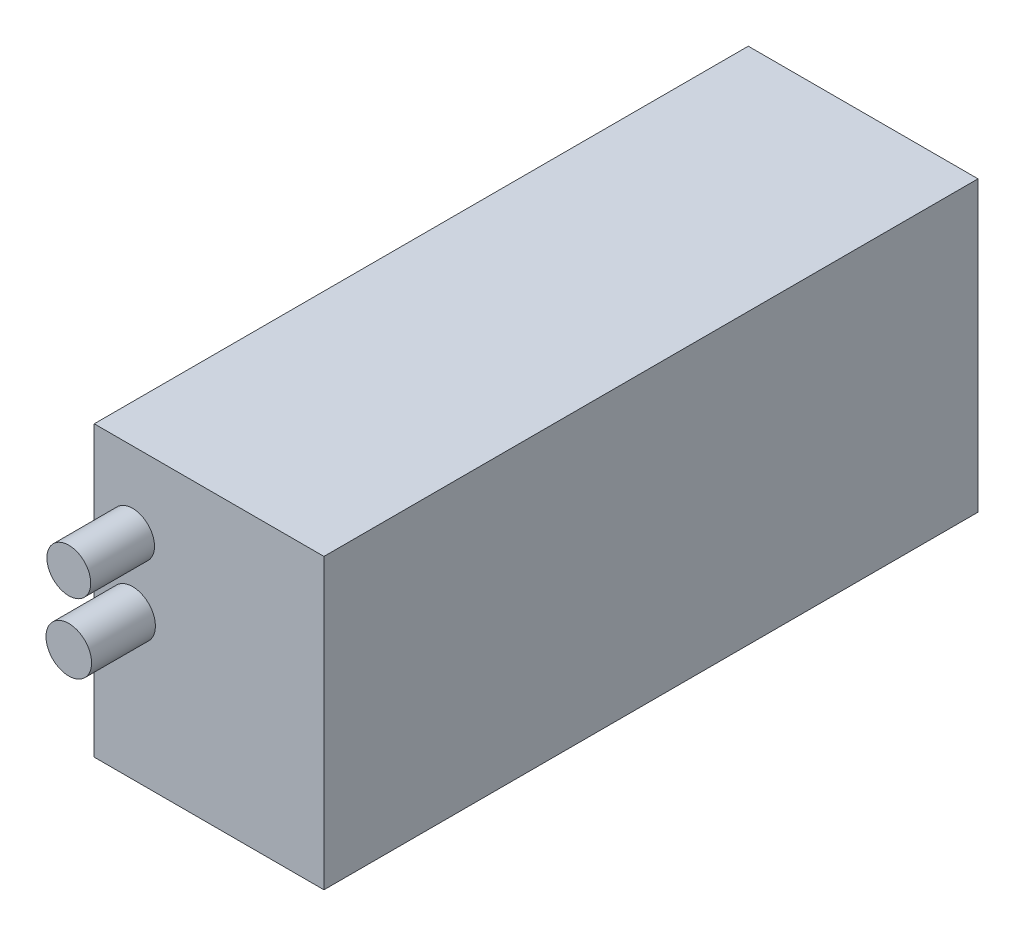
ISO-10303-21;
HEADER;
FILE_DESCRIPTION(('STEP AP214'),'2;1');
FILE_NAME('part.step','',(''),(''),'','','');
FILE_SCHEMA(('AUTOMOTIVE_DESIGN { 1 0 10303 214 1 1 1 1 }'));
ENDSEC;
DATA;
#1=APPLICATION_CONTEXT('core data for automotive mechanical design processes');
#2=APPLICATION_PROTOCOL_DEFINITION('international standard','automotive_design',2000,#1);
#3=PRODUCT_CONTEXT('',#1,'mechanical');
#4=PRODUCT('Part','Part','',(#3));
#5=PRODUCT_RELATED_PRODUCT_CATEGORY('part','',(#4));
#6=PRODUCT_DEFINITION_FORMATION('','',#4);
#7=PRODUCT_DEFINITION_CONTEXT('part definition',#1,'design');
#8=PRODUCT_DEFINITION('design','',#6,#7);
#9=PRODUCT_DEFINITION_SHAPE('','',#8);
#10=(LENGTH_UNIT() NAMED_UNIT(*) SI_UNIT(.MILLI.,.METRE.));
#11=(NAMED_UNIT(*) PLANE_ANGLE_UNIT() SI_UNIT($,.RADIAN.));
#12=(NAMED_UNIT(*) SI_UNIT($,.STERADIAN.) SOLID_ANGLE_UNIT());
#13=UNCERTAINTY_MEASURE_WITH_UNIT(LENGTH_MEASURE(1.E-05),#10,'distance_accuracy_value','');
#14=(GEOMETRIC_REPRESENTATION_CONTEXT(3) GLOBAL_UNCERTAINTY_ASSIGNED_CONTEXT((#13)) GLOBAL_UNIT_ASSIGNED_CONTEXT((#10,
#11,#12)) REPRESENTATION_CONTEXT('',''));
#15=CARTESIAN_POINT('',(0.,0.,0.));
#16=DIRECTION('',(0.,0.,1.));
#17=DIRECTION('',(1.,0.,0.));
#18=AXIS2_PLACEMENT_3D('',#15,#16,#17);
#19=CARTESIAN_POINT('',(36.,90.5,102.5));
#20=DIRECTION('',(-1.,0.,0.));
#21=DIRECTION('',(0.,0.,1.));
#22=AXIS2_PLACEMENT_3D('',#19,#20,#21);
#23=PLANE('',#22);
#24=DIRECTION('',(0.,0.,-1.));
#25=VECTOR('',#24,1.);
#26=CARTESIAN_POINT('',(36.,0.,102.5));
#27=LINE('',#26,#25);
#28=CARTESIAN_POINT('',(36.,0.,102.5));
#29=VERTEX_POINT('',#28);
#30=CARTESIAN_POINT('',(36.,0.,-102.5));
#31=VERTEX_POINT('',#30);
#32=EDGE_CURVE('E104',#29,#31,#27,.T.);
#33=ORIENTED_EDGE('',*,*,#32,.T.);
#34=DIRECTION('',(0.,-1.,0.));
#35=VECTOR('',#34,1.);
#36=CARTESIAN_POINT('',(36.,90.5,-102.5));
#37=LINE('',#36,#35);
#38=CARTESIAN_POINT('',(36.,90.5,-102.5));
#39=VERTEX_POINT('',#38);
#40=EDGE_CURVE('E95',#39,#31,#37,.T.);
#41=ORIENTED_EDGE('',*,*,#40,.F.);
#42=DIRECTION('',(0.,0.,-1.));
#43=VECTOR('',#42,1.);
#44=CARTESIAN_POINT('',(36.,90.5,102.5));
#45=LINE('',#44,#43);
#46=CARTESIAN_POINT('',(36.,90.5,102.5));
#47=VERTEX_POINT('',#46);
#48=EDGE_CURVE('E89',#47,#39,#45,.T.);
#49=ORIENTED_EDGE('',*,*,#48,.F.);
#50=DIRECTION('',(0.,-1.,0.));
#51=VECTOR('',#50,1.);
#52=CARTESIAN_POINT('',(36.,90.5,102.5));
#53=LINE('',#52,#51);
#54=EDGE_CURVE('E100',#47,#29,#53,.T.);
#55=ORIENTED_EDGE('',*,*,#54,.T.);
#56=EDGE_LOOP('',(#33,#41,#49,#55));
#57=FACE_BOUND('',#56,.T.);
#58=ADVANCED_FACE('F37',(#57),#23,.F.);
#59=CARTESIAN_POINT('',(-36.,90.5,-102.5));
#60=DIRECTION('',(0.,0.,1.));
#61=DIRECTION('',(1.,0.,0.));
#62=AXIS2_PLACEMENT_3D('',#59,#60,#61);
#63=PLANE('',#62);
#64=DIRECTION('',(-1.,0.,0.));
#65=VECTOR('',#64,1.);
#66=CARTESIAN_POINT('',(-36.,0.,-102.5));
#67=LINE('',#66,#65);
#68=CARTESIAN_POINT('',(-36.,0.,-102.5));
#69=VERTEX_POINT('',#68);
#70=EDGE_CURVE('E94',#31,#69,#67,.T.);
#71=ORIENTED_EDGE('',*,*,#70,.T.);
#72=DIRECTION('',(0.,-1.,0.));
#73=VECTOR('',#72,1.);
#74=CARTESIAN_POINT('',(-36.,90.5,-102.5));
#75=LINE('',#74,#73);
#76=CARTESIAN_POINT('',(-36.,90.5,-102.5));
#77=VERTEX_POINT('',#76);
#78=EDGE_CURVE('E92',#77,#69,#75,.T.);
#79=ORIENTED_EDGE('',*,*,#78,.F.);
#80=DIRECTION('',(-1.,0.,0.));
#81=VECTOR('',#80,1.);
#82=CARTESIAN_POINT('',(-36.,90.5,-102.5));
#83=LINE('',#82,#81);
#84=EDGE_CURVE('E84',#39,#77,#83,.T.);
#85=ORIENTED_EDGE('',*,*,#84,.F.);
#86=ORIENTED_EDGE('',*,*,#40,.T.);
#87=EDGE_LOOP('',(#71,#79,#85,#86));
#88=FACE_BOUND('',#87,.T.);
#89=ADVANCED_FACE('F93',(#88),#63,.F.);
#90=CARTESIAN_POINT('',(-36.,90.5,102.5));
#91=DIRECTION('',(1.,0.,0.));
#92=DIRECTION('',(0.,0.,-1.));
#93=AXIS2_PLACEMENT_3D('',#90,#91,#92);
#94=PLANE('',#93);
#95=DIRECTION('',(0.,0.,1.));
#96=VECTOR('',#95,1.);
#97=CARTESIAN_POINT('',(-36.,0.,102.5));
#98=LINE('',#97,#96);
#99=CARTESIAN_POINT('',(-36.,0.,102.5));
#100=VERTEX_POINT('',#99);
#101=EDGE_CURVE('E70',#69,#100,#98,.T.);
#102=ORIENTED_EDGE('',*,*,#101,.T.);
#103=DIRECTION('',(0.,-1.,0.));
#104=VECTOR('',#103,1.);
#105=CARTESIAN_POINT('',(-36.,90.5,102.5));
#106=LINE('',#105,#104);
#107=CARTESIAN_POINT('',(-36.,90.5,102.5));
#108=VERTEX_POINT('',#107);
#109=EDGE_CURVE('E96',#108,#100,#106,.T.);
#110=ORIENTED_EDGE('',*,*,#109,.F.);
#111=DIRECTION('',(0.,0.,1.));
#112=VECTOR('',#111,1.);
#113=CARTESIAN_POINT('',(-36.,90.5,102.5));
#114=LINE('',#113,#112);
#115=EDGE_CURVE('E87',#77,#108,#114,.T.);
#116=ORIENTED_EDGE('',*,*,#115,.F.);
#117=ORIENTED_EDGE('',*,*,#78,.T.);
#118=EDGE_LOOP('',(#102,#110,#116,#117));
#119=FACE_BOUND('',#118,.T.);
#120=ADVANCED_FACE('F98',(#119),#94,.F.);
#121=CARTESIAN_POINT('',(-36.,90.5,102.5));
#122=DIRECTION('',(0.,0.,-1.));
#123=DIRECTION('',(-1.,0.,0.));
#124=AXIS2_PLACEMENT_3D('',#121,#122,#123);
#125=PLANE('',#124);
#126=CARTESIAN_POINT('',(-23.9735437607465,45.1761138866118,102.5));
#127=DIRECTION('',(0.,0.,-1.));
#128=DIRECTION('',(-1.,0.,0.));
#129=AXIS2_PLACEMENT_3D('',#126,#127,#128);
#130=CIRCLE('',#129,7.14575609949268);
#131=CARTESIAN_POINT('',(-31.1192998602391,45.1761138866118,102.5));
#132=VERTEX_POINT('',#131);
#133=EDGE_CURVE('E11',#132,#132,#130,.F.);
#134=ORIENTED_EDGE('',*,*,#133,.F.);
#135=EDGE_LOOP('',(#134));
#136=FACE_BOUND('',#135,.T.);
#137=CARTESIAN_POINT('',(-23.9735437607465,66.6950888249858,102.5));
#138=DIRECTION('',(0.,0.,-1.));
#139=DIRECTION('',(-1.,0.,0.));
#140=AXIS2_PLACEMENT_3D('',#137,#138,#139);
#141=CIRCLE('',#140,6.86976989408095);
#142=CARTESIAN_POINT('',(-30.8433136548274,66.6950888249858,102.5));
#143=VERTEX_POINT('',#142);
#144=EDGE_CURVE('E45',#143,#143,#141,.F.);
#145=ORIENTED_EDGE('',*,*,#144,.F.);
#146=EDGE_LOOP('',(#145));
#147=FACE_BOUND('',#146,.T.);
#148=DIRECTION('',(1.,0.,0.));
#149=VECTOR('',#148,1.);
#150=CARTESIAN_POINT('',(-36.,0.,102.5));
#151=LINE('',#150,#149);
#152=EDGE_CURVE('E76',#100,#29,#151,.T.);
#153=ORIENTED_EDGE('',*,*,#152,.T.);
#154=ORIENTED_EDGE('',*,*,#54,.F.);
#155=DIRECTION('',(1.,0.,0.));
#156=VECTOR('',#155,1.);
#157=CARTESIAN_POINT('',(-36.,90.5,102.5));
#158=LINE('',#157,#156);
#159=EDGE_CURVE('E53',#108,#47,#158,.T.);
#160=ORIENTED_EDGE('',*,*,#159,.F.);
#161=ORIENTED_EDGE('',*,*,#109,.T.);
#162=EDGE_LOOP('',(#153,#154,#160,#161));
#163=FACE_BOUND('',#162,.T.);
#164=ADVANCED_FACE('F118',(#136,#147,#163),#125,.F.);
#165=CARTESIAN_POINT('',(0.,90.5,0.));
#166=DIRECTION('',(0.,-1.,0.));
#167=DIRECTION('',(0.,0.,-1.));
#168=AXIS2_PLACEMENT_3D('',#165,#166,#167);
#169=PLANE('',#168);
#170=ORIENTED_EDGE('',*,*,#48,.T.);
#171=ORIENTED_EDGE('',*,*,#84,.T.);
#172=ORIENTED_EDGE('',*,*,#115,.T.);
#173=ORIENTED_EDGE('',*,*,#159,.T.);
#174=EDGE_LOOP('',(#170,#171,#172,#173));
#175=FACE_BOUND('',#174,.T.);
#176=ADVANCED_FACE('F85',(#175),#169,.F.);
#177=CARTESIAN_POINT('',(0.,0.,0.));
#178=DIRECTION('',(0.,-1.,0.));
#179=DIRECTION('',(0.,0.,-1.));
#180=AXIS2_PLACEMENT_3D('',#177,#178,#179);
#181=PLANE('',#180);
#182=ORIENTED_EDGE('',*,*,#32,.F.);
#183=ORIENTED_EDGE('',*,*,#152,.F.);
#184=ORIENTED_EDGE('',*,*,#101,.F.);
#185=ORIENTED_EDGE('',*,*,#70,.F.);
#186=EDGE_LOOP('',(#182,#183,#184,#185));
#187=FACE_BOUND('',#186,.T.);
#188=ADVANCED_FACE('F126',(#187),#181,.T.);
#189=CARTESIAN_POINT('',(-23.9735437607465,66.6950888249858,122.5));
#190=DIRECTION('',(0.,0.,-1.));
#191=DIRECTION('',(-1.,0.,0.));
#192=AXIS2_PLACEMENT_3D('',#189,#190,#191);
#193=CYLINDRICAL_SURFACE('',#192,6.86976989408095);
#194=CARTESIAN_POINT('',(-23.9735437607465,66.6950888249858,122.5));
#195=DIRECTION('',(0.,0.,1.));
#196=DIRECTION('',(1.,0.,0.));
#197=AXIS2_PLACEMENT_3D('',#194,#195,#196);
#198=CIRCLE('',#197,6.86976989408095);
#199=CARTESIAN_POINT('',(-17.1037738666655,66.6950888249858,122.5));
#200=VERTEX_POINT('',#199);
#201=EDGE_CURVE('E107',#200,#200,#198,.T.);
#202=ORIENTED_EDGE('',*,*,#201,.F.);
#203=EDGE_LOOP('',(#202));
#204=FACE_BOUND('',#203,.T.);
#205=ORIENTED_EDGE('',*,*,#144,.T.);
#206=EDGE_LOOP('',(#205));
#207=FACE_BOUND('',#206,.T.);
#208=ADVANCED_FACE('F116',(#204,#207),#193,.T.);
#209=CARTESIAN_POINT('',(-23.9735437607465,66.6950888249858,122.5));
#210=DIRECTION('',(0.,0.,1.));
#211=DIRECTION('',(1.,0.,0.));
#212=AXIS2_PLACEMENT_3D('',#209,#210,#211);
#213=PLANE('',#212);
#214=ORIENTED_EDGE('',*,*,#201,.T.);
#215=EDGE_LOOP('',(#214));
#216=FACE_BOUND('',#215,.T.);
#217=ADVANCED_FACE('F142',(#216),#213,.T.);
#218=CARTESIAN_POINT('',(-23.9735437607465,45.1761138866118,122.5));
#219=DIRECTION('',(0.,0.,-1.));
#220=DIRECTION('',(-1.,0.,0.));
#221=AXIS2_PLACEMENT_3D('',#218,#219,#220);
#222=CYLINDRICAL_SURFACE('',#221,7.14575609949268);
#223=CARTESIAN_POINT('',(-23.9735437607465,45.1761138866118,122.5));
#224=DIRECTION('',(0.,0.,1.));
#225=DIRECTION('',(1.,0.,0.));
#226=AXIS2_PLACEMENT_3D('',#223,#224,#225);
#227=CIRCLE('',#226,7.14575609949268);
#228=CARTESIAN_POINT('',(-16.8277876612538,45.1761138866118,122.5));
#229=VERTEX_POINT('',#228);
#230=EDGE_CURVE('E160',#229,#229,#227,.T.);
#231=ORIENTED_EDGE('',*,*,#230,.F.);
#232=EDGE_LOOP('',(#231));
#233=FACE_BOUND('',#232,.T.);
#234=ORIENTED_EDGE('',*,*,#133,.T.);
#235=EDGE_LOOP('',(#234));
#236=FACE_BOUND('',#235,.T.);
#237=ADVANCED_FACE('F148',(#233,#236),#222,.T.);
#238=CARTESIAN_POINT('',(-23.9735437607465,45.1761138866118,122.5));
#239=DIRECTION('',(0.,0.,1.));
#240=DIRECTION('',(1.,0.,0.));
#241=AXIS2_PLACEMENT_3D('',#238,#239,#240);
#242=PLANE('',#241);
#243=ORIENTED_EDGE('',*,*,#230,.T.);
#244=EDGE_LOOP('',(#243));
#245=FACE_BOUND('',#244,.T.);
#246=ADVANCED_FACE('F152',(#245),#242,.T.);
#247=CLOSED_SHELL('',(#58,#89,#120,#164,#176,#188,#208,#217,#237,#246));
#248=MANIFOLD_SOLID_BREP('B2',#247);
#249=ADVANCED_BREP_SHAPE_REPRESENTATION('',(#18,#248),#14);
#250=SHAPE_DEFINITION_REPRESENTATION(#9,#249);
ENDSEC;
END-ISO-10303-21;
